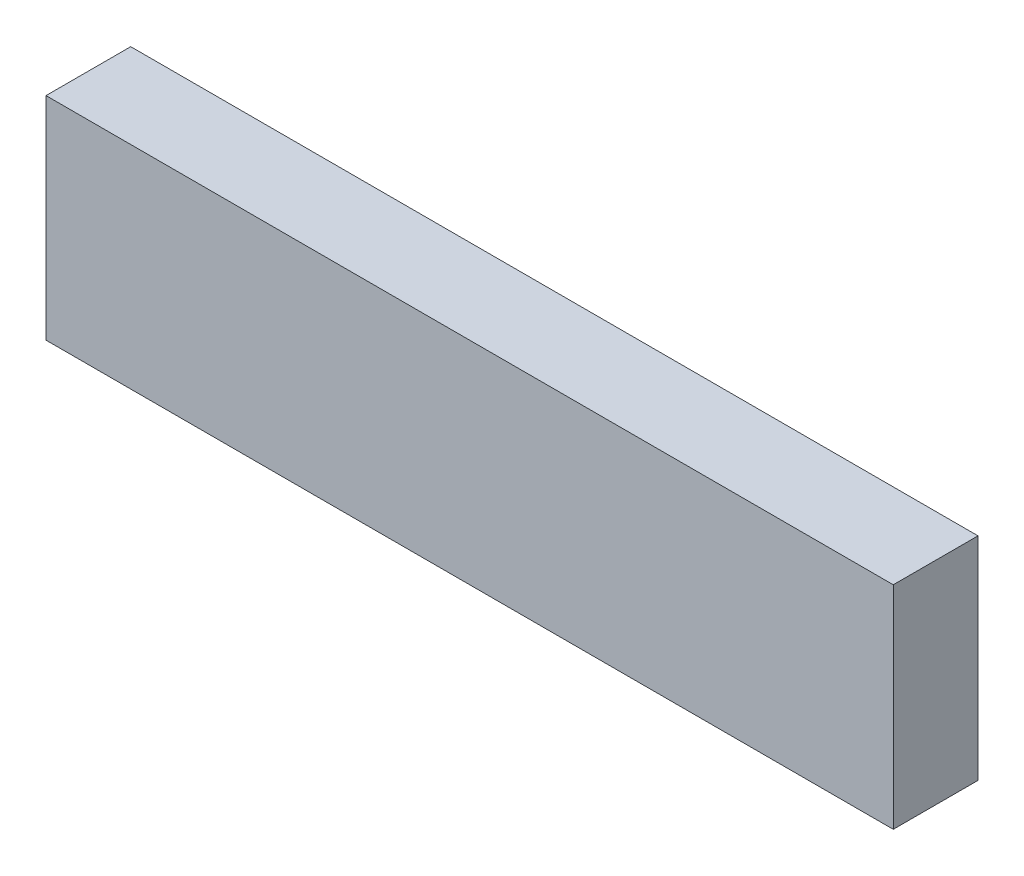
ISO-10303-21;
HEADER;
FILE_DESCRIPTION(('STEP AP214'),'2;1');
FILE_NAME('part.step','',(''),(''),'','','');
FILE_SCHEMA(('AUTOMOTIVE_DESIGN { 1 0 10303 214 1 1 1 1 }'));
ENDSEC;
DATA;
#1=APPLICATION_CONTEXT('core data for automotive mechanical design processes');
#2=APPLICATION_PROTOCOL_DEFINITION('international standard','automotive_design',2000,#1);
#3=PRODUCT_CONTEXT('',#1,'mechanical');
#4=PRODUCT('Part','Part','',(#3));
#5=PRODUCT_RELATED_PRODUCT_CATEGORY('part','',(#4));
#6=PRODUCT_DEFINITION_FORMATION('','',#4);
#7=PRODUCT_DEFINITION_CONTEXT('part definition',#1,'design');
#8=PRODUCT_DEFINITION('design','',#6,#7);
#9=PRODUCT_DEFINITION_SHAPE('','',#8);
#10=(LENGTH_UNIT() NAMED_UNIT(*) SI_UNIT(.MILLI.,.METRE.));
#11=(NAMED_UNIT(*) PLANE_ANGLE_UNIT() SI_UNIT($,.RADIAN.));
#12=(NAMED_UNIT(*) SI_UNIT($,.STERADIAN.) SOLID_ANGLE_UNIT());
#13=UNCERTAINTY_MEASURE_WITH_UNIT(LENGTH_MEASURE(1.E-05),#10,'distance_accuracy_value','');
#14=(GEOMETRIC_REPRESENTATION_CONTEXT(3) GLOBAL_UNCERTAINTY_ASSIGNED_CONTEXT((#13)) GLOBAL_UNIT_ASSIGNED_CONTEXT((#10,
#11,#12)) REPRESENTATION_CONTEXT('',''));
#15=CARTESIAN_POINT('',(0.,0.,0.));
#16=DIRECTION('',(0.,0.,1.));
#17=DIRECTION('',(1.,0.,0.));
#18=AXIS2_PLACEMENT_3D('',#15,#16,#17);
#19=CARTESIAN_POINT('',(96.,-50.01,55.8));
#20=DIRECTION('',(0.,0.,-1.));
#21=DIRECTION('',(-1.,0.,0.));
#22=AXIS2_PLACEMENT_3D('',#19,#20,#21);
#23=PLANE('',#22);
#24=DIRECTION('',(0.,1.,0.));
#25=VECTOR('',#24,1.);
#26=CARTESIAN_POINT('',(96.,-50.01,55.8));
#27=LINE('',#26,#25);
#28=CARTESIAN_POINT('',(96.,-50.,55.8));
#29=VERTEX_POINT('',#28);
#30=CARTESIAN_POINT('',(96.,-47.,55.8));
#31=VERTEX_POINT('',#30);
#32=EDGE_CURVE('E44',#29,#31,#27,.T.);
#33=ORIENTED_EDGE('',*,*,#32,.T.);
#34=DIRECTION('',(1.,0.,0.));
#35=VECTOR('',#34,1.);
#36=CARTESIAN_POINT('',(-300.,-47.,55.8));
#37=LINE('',#36,#35);
#38=CARTESIAN_POINT('',(108.,-47.,55.8));
#39=VERTEX_POINT('',#38);
#40=EDGE_CURVE('E94',#31,#39,#37,.T.);
#41=ORIENTED_EDGE('',*,*,#40,.T.);
#42=DIRECTION('',(0.,1.,0.));
#43=VECTOR('',#42,1.);
#44=CARTESIAN_POINT('',(108.,-50.01,55.8));
#45=LINE('',#44,#43);
#46=CARTESIAN_POINT('',(108.,-50.,55.8));
#47=VERTEX_POINT('',#46);
#48=EDGE_CURVE('E11',#47,#39,#45,.T.);
#49=ORIENTED_EDGE('',*,*,#48,.F.);
#50=DIRECTION('',(-1.,0.,0.));
#51=VECTOR('',#50,1.);
#52=CARTESIAN_POINT('',(-300.,-50.,55.8));
#53=LINE('',#52,#51);
#54=EDGE_CURVE('E39',#47,#29,#53,.T.);
#55=ORIENTED_EDGE('',*,*,#54,.T.);
#56=EDGE_LOOP('',(#33,#41,#49,#55));
#57=FACE_BOUND('',#56,.T.);
#58=ADVANCED_FACE('F35',(#57),#23,.T.);
#59=CARTESIAN_POINT('',(96.,-50.01,55.8));
#60=DIRECTION('',(-1.,0.,0.));
#61=DIRECTION('',(0.,0.,1.));
#62=AXIS2_PLACEMENT_3D('',#59,#60,#61);
#63=PLANE('',#62);
#64=DIRECTION('',(0.,1.,0.));
#65=VECTOR('',#64,1.);
#66=CARTESIAN_POINT('',(96.,-50.01,57.));
#67=LINE('',#66,#65);
#68=CARTESIAN_POINT('',(96.,-50.,57.));
#69=VERTEX_POINT('',#68);
#70=CARTESIAN_POINT('',(96.,-47.,57.));
#71=VERTEX_POINT('',#70);
#72=EDGE_CURVE('E73',#69,#71,#67,.T.);
#73=ORIENTED_EDGE('',*,*,#72,.T.);
#74=DIRECTION('',(0.,0.,-1.));
#75=VECTOR('',#74,1.);
#76=CARTESIAN_POINT('',(96.,-47.,3.));
#77=LINE('',#76,#75);
#78=EDGE_CURVE('E77',#71,#31,#77,.T.);
#79=ORIENTED_EDGE('',*,*,#78,.T.);
#80=ORIENTED_EDGE('',*,*,#32,.F.);
#81=DIRECTION('',(0.,0.,1.));
#82=VECTOR('',#81,1.);
#83=CARTESIAN_POINT('',(96.,-50.,60.));
#84=LINE('',#83,#82);
#85=EDGE_CURVE('E79',#29,#69,#84,.T.);
#86=ORIENTED_EDGE('',*,*,#85,.T.);
#87=EDGE_LOOP('',(#73,#79,#80,#86));
#88=FACE_BOUND('',#87,.T.);
#89=ADVANCED_FACE('F75',(#88),#63,.T.);
#90=CARTESIAN_POINT('',(108.,-50.01,55.8));
#91=DIRECTION('',(1.,0.,0.));
#92=DIRECTION('',(0.,0.,-1.));
#93=AXIS2_PLACEMENT_3D('',#90,#91,#92);
#94=PLANE('',#93);
#95=ORIENTED_EDGE('',*,*,#48,.T.);
#96=DIRECTION('',(0.,0.,1.));
#97=VECTOR('',#96,1.);
#98=CARTESIAN_POINT('',(108.,-47.,3.));
#99=LINE('',#98,#97);
#100=CARTESIAN_POINT('',(108.,-47.,57.));
#101=VERTEX_POINT('',#100);
#102=EDGE_CURVE('E91',#39,#101,#99,.T.);
#103=ORIENTED_EDGE('',*,*,#102,.T.);
#104=DIRECTION('',(0.,1.,0.));
#105=VECTOR('',#104,1.);
#106=CARTESIAN_POINT('',(108.,-50.01,57.));
#107=LINE('',#106,#105);
#108=CARTESIAN_POINT('',(108.,-50.,57.));
#109=VERTEX_POINT('',#108);
#110=EDGE_CURVE('E83',#109,#101,#107,.T.);
#111=ORIENTED_EDGE('',*,*,#110,.F.);
#112=DIRECTION('',(0.,0.,-1.));
#113=VECTOR('',#112,1.);
#114=CARTESIAN_POINT('',(108.,-50.,60.));
#115=LINE('',#114,#113);
#116=EDGE_CURVE('E102',#109,#47,#115,.T.);
#117=ORIENTED_EDGE('',*,*,#116,.T.);
#118=EDGE_LOOP('',(#95,#103,#111,#117));
#119=FACE_BOUND('',#118,.T.);
#120=ADVANCED_FACE('F113',(#119),#94,.T.);
#121=CARTESIAN_POINT('',(96.,-50.01,57.));
#122=DIRECTION('',(0.,0.,1.));
#123=DIRECTION('',(1.,0.,0.));
#124=AXIS2_PLACEMENT_3D('',#121,#122,#123);
#125=PLANE('',#124);
#126=ORIENTED_EDGE('',*,*,#110,.T.);
#127=DIRECTION('',(-1.,0.,0.));
#128=VECTOR('',#127,1.);
#129=CARTESIAN_POINT('',(-300.,-47.,57.));
#130=LINE('',#129,#128);
#131=EDGE_CURVE('E86',#101,#71,#130,.T.);
#132=ORIENTED_EDGE('',*,*,#131,.T.);
#133=ORIENTED_EDGE('',*,*,#72,.F.);
#134=DIRECTION('',(1.,0.,0.));
#135=VECTOR('',#134,1.);
#136=CARTESIAN_POINT('',(-300.,-50.,57.));
#137=LINE('',#136,#135);
#138=EDGE_CURVE('E101',#69,#109,#137,.T.);
#139=ORIENTED_EDGE('',*,*,#138,.T.);
#140=EDGE_LOOP('',(#126,#132,#133,#139));
#141=FACE_BOUND('',#140,.T.);
#142=ADVANCED_FACE('F87',(#141),#125,.T.);
#143=CARTESIAN_POINT('',(-300.,-50.,60.));
#144=DIRECTION('',(0.,1.,0.));
#145=DIRECTION('',(0.,0.,1.));
#146=AXIS2_PLACEMENT_3D('',#143,#144,#145);
#147=PLANE('',#146);
#148=ORIENTED_EDGE('',*,*,#85,.F.);
#149=ORIENTED_EDGE('',*,*,#54,.F.);
#150=ORIENTED_EDGE('',*,*,#116,.F.);
#151=ORIENTED_EDGE('',*,*,#138,.F.);
#152=EDGE_LOOP('',(#148,#149,#150,#151));
#153=FACE_BOUND('',#152,.T.);
#154=ADVANCED_FACE('F107',(#153),#147,.F.);
#155=CARTESIAN_POINT('',(-300.,-47.,3.));
#156=DIRECTION('',(0.,-1.,0.));
#157=DIRECTION('',(0.,0.,-1.));
#158=AXIS2_PLACEMENT_3D('',#155,#156,#157);
#159=PLANE('',#158);
#160=ORIENTED_EDGE('',*,*,#78,.F.);
#161=ORIENTED_EDGE('',*,*,#131,.F.);
#162=ORIENTED_EDGE('',*,*,#102,.F.);
#163=ORIENTED_EDGE('',*,*,#40,.F.);
#164=EDGE_LOOP('',(#160,#161,#162,#163));
#165=FACE_BOUND('',#164,.T.);
#166=ADVANCED_FACE('F37',(#165),#159,.F.);
#167=CLOSED_SHELL('',(#58,#89,#120,#142,#154,#166));
#168=MANIFOLD_SOLID_BREP('B2',#167);
#169=ADVANCED_BREP_SHAPE_REPRESENTATION('',(#18,#168),#14);
#170=SHAPE_DEFINITION_REPRESENTATION(#9,#169);
ENDSEC;
END-ISO-10303-21;
